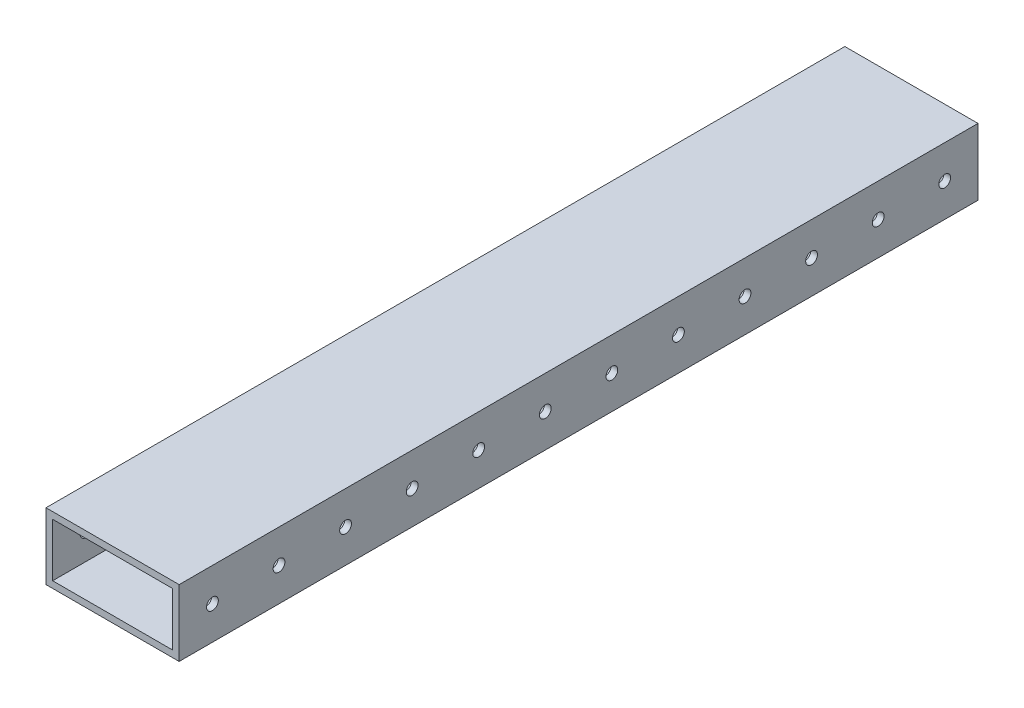
ISO-10303-21;
HEADER;
FILE_DESCRIPTION(('STEP AP214'),'2;1');
FILE_NAME('part.step','',(''),(''),'','','');
FILE_SCHEMA(('AUTOMOTIVE_DESIGN { 1 0 10303 214 1 1 1 1 }'));
ENDSEC;
DATA;
#1=APPLICATION_CONTEXT('core data for automotive mechanical design processes');
#2=APPLICATION_PROTOCOL_DEFINITION('international standard','automotive_design',2000,#1);
#3=PRODUCT_CONTEXT('',#1,'mechanical');
#4=PRODUCT('Part','Part','',(#3));
#5=PRODUCT_RELATED_PRODUCT_CATEGORY('part','',(#4));
#6=PRODUCT_DEFINITION_FORMATION('','',#4);
#7=PRODUCT_DEFINITION_CONTEXT('part definition',#1,'design');
#8=PRODUCT_DEFINITION('design','',#6,#7);
#9=PRODUCT_DEFINITION_SHAPE('','',#8);
#10=(LENGTH_UNIT() NAMED_UNIT(*) SI_UNIT(.MILLI.,.METRE.));
#11=(NAMED_UNIT(*) PLANE_ANGLE_UNIT() SI_UNIT($,.RADIAN.));
#12=(NAMED_UNIT(*) SI_UNIT($,.STERADIAN.) SOLID_ANGLE_UNIT());
#13=UNCERTAINTY_MEASURE_WITH_UNIT(LENGTH_MEASURE(1.E-05),#10,'distance_accuracy_value','');
#14=(GEOMETRIC_REPRESENTATION_CONTEXT(3) GLOBAL_UNCERTAINTY_ASSIGNED_CONTEXT((#13)) GLOBAL_UNIT_ASSIGNED_CONTEXT((#10,
#11,#12)) REPRESENTATION_CONTEXT('',''));
#15=CARTESIAN_POINT('',(0.,0.,0.));
#16=DIRECTION('',(0.,0.,1.));
#17=DIRECTION('',(1.,0.,0.));
#18=AXIS2_PLACEMENT_3D('',#15,#16,#17);
#19=CARTESIAN_POINT('',(-25.4,-12.7,-533.4));
#20=DIRECTION('',(-1.,0.,0.));
#21=DIRECTION('',(0.,0.,1.));
#22=AXIS2_PLACEMENT_3D('',#19,#20,#21);
#23=PLANE('',#22);
#24=DIRECTION('',(0.,-1.,0.));
#25=VECTOR('',#24,1.);
#26=CARTESIAN_POINT('',(-25.4,-12.7,-228.6));
#27=LINE('',#26,#25);
#28=CARTESIAN_POINT('',(-25.4,12.7,-228.6));
#29=VERTEX_POINT('',#28);
#30=CARTESIAN_POINT('',(-25.4,-12.7,-228.6));
#31=VERTEX_POINT('',#30);
#32=EDGE_CURVE('E102',#29,#31,#27,.T.);
#33=ORIENTED_EDGE('',*,*,#32,.F.);
#34=DIRECTION('',(0.,0.,1.));
#35=VECTOR('',#34,1.);
#36=CARTESIAN_POINT('',(-25.4,12.7,-533.4));
#37=LINE('',#36,#35);
#38=CARTESIAN_POINT('',(-25.4,12.7,-533.4));
#39=VERTEX_POINT('',#38);
#40=EDGE_CURVE('E112',#39,#29,#37,.T.);
#41=ORIENTED_EDGE('',*,*,#40,.F.);
#42=DIRECTION('',(0.,-1.,0.));
#43=VECTOR('',#42,1.);
#44=CARTESIAN_POINT('',(-25.4,-12.7,-533.4));
#45=LINE('',#44,#43);
#46=CARTESIAN_POINT('',(-25.4,-12.7,-533.4));
#47=VERTEX_POINT('',#46);
#48=EDGE_CURVE('E301',#39,#47,#45,.T.);
#49=ORIENTED_EDGE('',*,*,#48,.T.);
#50=DIRECTION('',(0.,0.,1.));
#51=VECTOR('',#50,1.);
#52=CARTESIAN_POINT('',(-25.4,-12.7,-533.4));
#53=LINE('',#52,#51);
#54=EDGE_CURVE('E114',#47,#31,#53,.T.);
#55=ORIENTED_EDGE('',*,*,#54,.T.);
#56=EDGE_LOOP('',(#33,#41,#49,#55));
#57=FACE_BOUND('',#56,.T.);
#58=CARTESIAN_POINT('',(-25.4,0.,-241.3));
#59=DIRECTION('',(1.,0.,0.));
#60=DIRECTION('',(0.,0.,-1.));
#61=AXIS2_PLACEMENT_3D('',#58,#59,#60);
#62=CIRCLE('',#61,2.24789999999999);
#63=CARTESIAN_POINT('',(-25.4,0.,-243.5479));
#64=VERTEX_POINT('',#63);
#65=EDGE_CURVE('E180',#64,#64,#62,.T.);
#66=ORIENTED_EDGE('',*,*,#65,.T.);
#67=EDGE_LOOP('',(#66));
#68=FACE_BOUND('',#67,.T.);
#69=CARTESIAN_POINT('',(-25.4,0.,-266.7));
#70=DIRECTION('',(1.,0.,0.));
#71=DIRECTION('',(0.,0.,-1.));
#72=AXIS2_PLACEMENT_3D('',#69,#70,#71);
#73=CIRCLE('',#72,2.24789999999999);
#74=CARTESIAN_POINT('',(-25.4,0.,-268.9479));
#75=VERTEX_POINT('',#74);
#76=EDGE_CURVE('E176',#75,#75,#73,.T.);
#77=ORIENTED_EDGE('',*,*,#76,.T.);
#78=EDGE_LOOP('',(#77));
#79=FACE_BOUND('',#78,.T.);
#80=CARTESIAN_POINT('',(-25.4,0.,-292.1));
#81=DIRECTION('',(1.,0.,0.));
#82=DIRECTION('',(0.,0.,-1.));
#83=AXIS2_PLACEMENT_3D('',#80,#81,#82);
#84=CIRCLE('',#83,2.24789999999999);
#85=CARTESIAN_POINT('',(-25.4,0.,-294.3479));
#86=VERTEX_POINT('',#85);
#87=EDGE_CURVE('E172',#86,#86,#84,.T.);
#88=ORIENTED_EDGE('',*,*,#87,.T.);
#89=EDGE_LOOP('',(#88));
#90=FACE_BOUND('',#89,.T.);
#91=CARTESIAN_POINT('',(-25.4,0.,-317.5));
#92=DIRECTION('',(1.,0.,0.));
#93=DIRECTION('',(0.,0.,-1.));
#94=AXIS2_PLACEMENT_3D('',#91,#92,#93);
#95=CIRCLE('',#94,2.24789999999999);
#96=CARTESIAN_POINT('',(-25.4,0.,-319.7479));
#97=VERTEX_POINT('',#96);
#98=EDGE_CURVE('E167',#97,#97,#95,.T.);
#99=ORIENTED_EDGE('',*,*,#98,.T.);
#100=EDGE_LOOP('',(#99));
#101=FACE_BOUND('',#100,.T.);
#102=CARTESIAN_POINT('',(-25.4,0.,-342.9));
#103=DIRECTION('',(1.,0.,0.));
#104=DIRECTION('',(0.,0.,-1.));
#105=AXIS2_PLACEMENT_3D('',#102,#103,#104);
#106=CIRCLE('',#105,2.24789999999999);
#107=CARTESIAN_POINT('',(-25.4,0.,-345.1479));
#108=VERTEX_POINT('',#107);
#109=EDGE_CURVE('E162',#108,#108,#106,.T.);
#110=ORIENTED_EDGE('',*,*,#109,.T.);
#111=EDGE_LOOP('',(#110));
#112=FACE_BOUND('',#111,.T.);
#113=CARTESIAN_POINT('',(-25.4,0.,-368.3));
#114=DIRECTION('',(1.,0.,0.));
#115=DIRECTION('',(0.,0.,-1.));
#116=AXIS2_PLACEMENT_3D('',#113,#114,#115);
#117=CIRCLE('',#116,2.24789999999999);
#118=CARTESIAN_POINT('',(-25.4,0.,-370.5479));
#119=VERTEX_POINT('',#118);
#120=EDGE_CURVE('E157',#119,#119,#117,.T.);
#121=ORIENTED_EDGE('',*,*,#120,.T.);
#122=EDGE_LOOP('',(#121));
#123=FACE_BOUND('',#122,.T.);
#124=CARTESIAN_POINT('',(-25.4,0.,-393.7));
#125=DIRECTION('',(1.,0.,0.));
#126=DIRECTION('',(0.,0.,-1.));
#127=AXIS2_PLACEMENT_3D('',#124,#125,#126);
#128=CIRCLE('',#127,2.24789999999999);
#129=CARTESIAN_POINT('',(-25.4,0.,-395.9479));
#130=VERTEX_POINT('',#129);
#131=EDGE_CURVE('E152',#130,#130,#128,.T.);
#132=ORIENTED_EDGE('',*,*,#131,.T.);
#133=EDGE_LOOP('',(#132));
#134=FACE_BOUND('',#133,.T.);
#135=CARTESIAN_POINT('',(-25.4,0.,-419.1));
#136=DIRECTION('',(1.,0.,0.));
#137=DIRECTION('',(0.,0.,-1.));
#138=AXIS2_PLACEMENT_3D('',#135,#136,#137);
#139=CIRCLE('',#138,2.24789999999999);
#140=CARTESIAN_POINT('',(-25.4,0.,-421.3479));
#141=VERTEX_POINT('',#140);
#142=EDGE_CURVE('E147',#141,#141,#139,.T.);
#143=ORIENTED_EDGE('',*,*,#142,.T.);
#144=EDGE_LOOP('',(#143));
#145=FACE_BOUND('',#144,.T.);
#146=CARTESIAN_POINT('',(-25.4,0.,-444.5));
#147=DIRECTION('',(1.,0.,0.));
#148=DIRECTION('',(0.,0.,-1.));
#149=AXIS2_PLACEMENT_3D('',#146,#147,#148);
#150=CIRCLE('',#149,2.24789999999999);
#151=CARTESIAN_POINT('',(-25.4,0.,-446.7479));
#152=VERTEX_POINT('',#151);
#153=EDGE_CURVE('E142',#152,#152,#150,.T.);
#154=ORIENTED_EDGE('',*,*,#153,.T.);
#155=EDGE_LOOP('',(#154));
#156=FACE_BOUND('',#155,.T.);
#157=CARTESIAN_POINT('',(-25.4,0.,-469.9));
#158=DIRECTION('',(1.,0.,0.));
#159=DIRECTION('',(0.,0.,-1.));
#160=AXIS2_PLACEMENT_3D('',#157,#158,#159);
#161=CIRCLE('',#160,2.24789999999999);
#162=CARTESIAN_POINT('',(-25.4,0.,-472.1479));
#163=VERTEX_POINT('',#162);
#164=EDGE_CURVE('E137',#163,#163,#161,.T.);
#165=ORIENTED_EDGE('',*,*,#164,.T.);
#166=EDGE_LOOP('',(#165));
#167=FACE_BOUND('',#166,.T.);
#168=CARTESIAN_POINT('',(-25.4,0.,-495.3));
#169=DIRECTION('',(1.,0.,0.));
#170=DIRECTION('',(0.,0.,-1.));
#171=AXIS2_PLACEMENT_3D('',#168,#169,#170);
#172=CIRCLE('',#171,2.24789999999999);
#173=CARTESIAN_POINT('',(-25.4,0.,-497.5479));
#174=VERTEX_POINT('',#173);
#175=EDGE_CURVE('E132',#174,#174,#172,.T.);
#176=ORIENTED_EDGE('',*,*,#175,.T.);
#177=EDGE_LOOP('',(#176));
#178=FACE_BOUND('',#177,.T.);
#179=CARTESIAN_POINT('',(-25.4,0.,-520.7));
#180=DIRECTION('',(1.,0.,0.));
#181=DIRECTION('',(0.,0.,-1.));
#182=AXIS2_PLACEMENT_3D('',#179,#180,#181);
#183=CIRCLE('',#182,2.24789999999999);
#184=CARTESIAN_POINT('',(-25.4,0.,-522.9479));
#185=VERTEX_POINT('',#184);
#186=EDGE_CURVE('E264',#185,#185,#183,.T.);
#187=ORIENTED_EDGE('',*,*,#186,.T.);
#188=EDGE_LOOP('',(#187));
#189=FACE_BOUND('',#188,.T.);
#190=ADVANCED_FACE('F38',(#57,#68,#79,#90,#101,#112,#123,#134,#145,#156,#167,#178,#189),#23,.T.);
#191=CARTESIAN_POINT('',(25.4,-12.7,-533.4));
#192=DIRECTION('',(1.,0.,0.));
#193=DIRECTION('',(0.,0.,-1.));
#194=AXIS2_PLACEMENT_3D('',#191,#192,#193);
#195=PLANE('',#194);
#196=DIRECTION('',(0.,1.,0.));
#197=VECTOR('',#196,1.);
#198=CARTESIAN_POINT('',(25.4,-12.7,-228.6));
#199=LINE('',#198,#197);
#200=CARTESIAN_POINT('',(25.4,-12.7,-228.6));
#201=VERTEX_POINT('',#200);
#202=CARTESIAN_POINT('',(25.4,12.7,-228.6));
#203=VERTEX_POINT('',#202);
#204=EDGE_CURVE('E53',#201,#203,#199,.T.);
#205=ORIENTED_EDGE('',*,*,#204,.F.);
#206=DIRECTION('',(0.,0.,1.));
#207=VECTOR('',#206,1.);
#208=CARTESIAN_POINT('',(25.4,-12.7,-533.4));
#209=LINE('',#208,#207);
#210=CARTESIAN_POINT('',(25.4,-12.7,-533.4));
#211=VERTEX_POINT('',#210);
#212=EDGE_CURVE('E46',#211,#201,#209,.T.);
#213=ORIENTED_EDGE('',*,*,#212,.F.);
#214=DIRECTION('',(0.,1.,0.));
#215=VECTOR('',#214,1.);
#216=CARTESIAN_POINT('',(25.4,-12.7,-533.4));
#217=LINE('',#216,#215);
#218=CARTESIAN_POINT('',(25.4,12.7,-533.4));
#219=VERTEX_POINT('',#218);
#220=EDGE_CURVE('E289',#211,#219,#217,.T.);
#221=ORIENTED_EDGE('',*,*,#220,.T.);
#222=DIRECTION('',(0.,0.,1.));
#223=VECTOR('',#222,1.);
#224=CARTESIAN_POINT('',(25.4,12.7,-533.4));
#225=LINE('',#224,#223);
#226=EDGE_CURVE('E121',#219,#203,#225,.T.);
#227=ORIENTED_EDGE('',*,*,#226,.T.);
#228=EDGE_LOOP('',(#205,#213,#221,#227));
#229=FACE_BOUND('',#228,.T.);
#230=CARTESIAN_POINT('',(25.4,0.,-241.3));
#231=DIRECTION('',(1.,0.,0.));
#232=DIRECTION('',(0.,0.,-1.));
#233=AXIS2_PLACEMENT_3D('',#230,#231,#232);
#234=CIRCLE('',#233,2.24789999999999);
#235=CARTESIAN_POINT('',(25.4,0.,-243.5479));
#236=VERTEX_POINT('',#235);
#237=EDGE_CURVE('E115',#236,#236,#234,.T.);
#238=ORIENTED_EDGE('',*,*,#237,.F.);
#239=EDGE_LOOP('',(#238));
#240=FACE_BOUND('',#239,.T.);
#241=CARTESIAN_POINT('',(25.4,0.,-266.7));
#242=DIRECTION('',(1.,0.,0.));
#243=DIRECTION('',(0.,0.,-1.));
#244=AXIS2_PLACEMENT_3D('',#241,#242,#243);
#245=CIRCLE('',#244,2.24789999999999);
#246=CARTESIAN_POINT('',(25.4,0.,-268.9479));
#247=VERTEX_POINT('',#246);
#248=EDGE_CURVE('E184',#247,#247,#245,.T.);
#249=ORIENTED_EDGE('',*,*,#248,.F.);
#250=EDGE_LOOP('',(#249));
#251=FACE_BOUND('',#250,.T.);
#252=CARTESIAN_POINT('',(25.4,0.,-292.1));
#253=DIRECTION('',(1.,0.,0.));
#254=DIRECTION('',(0.,0.,-1.));
#255=AXIS2_PLACEMENT_3D('',#252,#253,#254);
#256=CIRCLE('',#255,2.24789999999999);
#257=CARTESIAN_POINT('',(25.4,0.,-294.3479));
#258=VERTEX_POINT('',#257);
#259=EDGE_CURVE('E198',#258,#258,#256,.T.);
#260=ORIENTED_EDGE('',*,*,#259,.F.);
#261=EDGE_LOOP('',(#260));
#262=FACE_BOUND('',#261,.T.);
#263=CARTESIAN_POINT('',(25.4,0.,-317.5));
#264=DIRECTION('',(1.,0.,0.));
#265=DIRECTION('',(0.,0.,-1.));
#266=AXIS2_PLACEMENT_3D('',#263,#264,#265);
#267=CIRCLE('',#266,2.24789999999999);
#268=CARTESIAN_POINT('',(25.4,0.,-319.7479));
#269=VERTEX_POINT('',#268);
#270=EDGE_CURVE('E205',#269,#269,#267,.T.);
#271=ORIENTED_EDGE('',*,*,#270,.F.);
#272=EDGE_LOOP('',(#271));
#273=FACE_BOUND('',#272,.T.);
#274=CARTESIAN_POINT('',(25.4,0.,-342.9));
#275=DIRECTION('',(1.,0.,0.));
#276=DIRECTION('',(0.,0.,-1.));
#277=AXIS2_PLACEMENT_3D('',#274,#275,#276);
#278=CIRCLE('',#277,2.24789999999999);
#279=CARTESIAN_POINT('',(25.4,0.,-345.1479));
#280=VERTEX_POINT('',#279);
#281=EDGE_CURVE('E212',#280,#280,#278,.T.);
#282=ORIENTED_EDGE('',*,*,#281,.F.);
#283=EDGE_LOOP('',(#282));
#284=FACE_BOUND('',#283,.T.);
#285=CARTESIAN_POINT('',(25.4,0.,-368.3));
#286=DIRECTION('',(1.,0.,0.));
#287=DIRECTION('',(0.,0.,-1.));
#288=AXIS2_PLACEMENT_3D('',#285,#286,#287);
#289=CIRCLE('',#288,2.24789999999999);
#290=CARTESIAN_POINT('',(25.4,0.,-370.5479));
#291=VERTEX_POINT('',#290);
#292=EDGE_CURVE('E219',#291,#291,#289,.T.);
#293=ORIENTED_EDGE('',*,*,#292,.F.);
#294=EDGE_LOOP('',(#293));
#295=FACE_BOUND('',#294,.T.);
#296=CARTESIAN_POINT('',(25.4,0.,-393.7));
#297=DIRECTION('',(1.,0.,0.));
#298=DIRECTION('',(0.,0.,-1.));
#299=AXIS2_PLACEMENT_3D('',#296,#297,#298);
#300=CIRCLE('',#299,2.24789999999999);
#301=CARTESIAN_POINT('',(25.4,0.,-395.9479));
#302=VERTEX_POINT('',#301);
#303=EDGE_CURVE('E226',#302,#302,#300,.T.);
#304=ORIENTED_EDGE('',*,*,#303,.F.);
#305=EDGE_LOOP('',(#304));
#306=FACE_BOUND('',#305,.T.);
#307=CARTESIAN_POINT('',(25.4,0.,-419.1));
#308=DIRECTION('',(1.,0.,0.));
#309=DIRECTION('',(0.,0.,-1.));
#310=AXIS2_PLACEMENT_3D('',#307,#308,#309);
#311=CIRCLE('',#310,2.24789999999999);
#312=CARTESIAN_POINT('',(25.4,0.,-421.3479));
#313=VERTEX_POINT('',#312);
#314=EDGE_CURVE('E233',#313,#313,#311,.T.);
#315=ORIENTED_EDGE('',*,*,#314,.F.);
#316=EDGE_LOOP('',(#315));
#317=FACE_BOUND('',#316,.T.);
#318=CARTESIAN_POINT('',(25.4,0.,-444.5));
#319=DIRECTION('',(1.,0.,0.));
#320=DIRECTION('',(0.,0.,-1.));
#321=AXIS2_PLACEMENT_3D('',#318,#319,#320);
#322=CIRCLE('',#321,2.24789999999999);
#323=CARTESIAN_POINT('',(25.4,0.,-446.7479));
#324=VERTEX_POINT('',#323);
#325=EDGE_CURVE('E240',#324,#324,#322,.T.);
#326=ORIENTED_EDGE('',*,*,#325,.F.);
#327=EDGE_LOOP('',(#326));
#328=FACE_BOUND('',#327,.T.);
#329=CARTESIAN_POINT('',(25.4,0.,-469.9));
#330=DIRECTION('',(1.,0.,0.));
#331=DIRECTION('',(0.,0.,-1.));
#332=AXIS2_PLACEMENT_3D('',#329,#330,#331);
#333=CIRCLE('',#332,2.24789999999999);
#334=CARTESIAN_POINT('',(25.4,0.,-472.1479));
#335=VERTEX_POINT('',#334);
#336=EDGE_CURVE('E247',#335,#335,#333,.T.);
#337=ORIENTED_EDGE('',*,*,#336,.F.);
#338=EDGE_LOOP('',(#337));
#339=FACE_BOUND('',#338,.T.);
#340=CARTESIAN_POINT('',(25.4,0.,-495.3));
#341=DIRECTION('',(1.,0.,0.));
#342=DIRECTION('',(0.,0.,-1.));
#343=AXIS2_PLACEMENT_3D('',#340,#341,#342);
#344=CIRCLE('',#343,2.24789999999999);
#345=CARTESIAN_POINT('',(25.4,0.,-497.5479));
#346=VERTEX_POINT('',#345);
#347=EDGE_CURVE('E254',#346,#346,#344,.T.);
#348=ORIENTED_EDGE('',*,*,#347,.F.);
#349=EDGE_LOOP('',(#348));
#350=FACE_BOUND('',#349,.T.);
#351=CARTESIAN_POINT('',(25.4,0.,-520.7));
#352=DIRECTION('',(1.,0.,0.));
#353=DIRECTION('',(0.,0.,-1.));
#354=AXIS2_PLACEMENT_3D('',#351,#352,#353);
#355=CIRCLE('',#354,2.24789999999999);
#356=CARTESIAN_POINT('',(25.4,0.,-522.9479));
#357=VERTEX_POINT('',#356);
#358=EDGE_CURVE('E261',#357,#357,#355,.T.);
#359=ORIENTED_EDGE('',*,*,#358,.F.);
#360=EDGE_LOOP('',(#359));
#361=FACE_BOUND('',#360,.T.);
#362=ADVANCED_FACE('F40',(#229,#240,#251,#262,#273,#284,#295,#306,#317,#328,#339,#350,#361),
#195,.T.);
#363=CARTESIAN_POINT('',(-25.4,-12.7,-533.4));
#364=DIRECTION('',(0.,-1.,0.));
#365=DIRECTION('',(0.,0.,-1.));
#366=AXIS2_PLACEMENT_3D('',#363,#364,#365);
#367=PLANE('',#366);
#368=DIRECTION('',(1.,0.,0.));
#369=VECTOR('',#368,1.);
#370=CARTESIAN_POINT('',(-25.4,-12.7,-228.6));
#371=LINE('',#370,#369);
#372=EDGE_CURVE('E307',#31,#201,#371,.T.);
#373=ORIENTED_EDGE('',*,*,#372,.F.);
#374=ORIENTED_EDGE('',*,*,#54,.F.);
#375=DIRECTION('',(1.,0.,0.));
#376=VECTOR('',#375,1.);
#377=CARTESIAN_POINT('',(-25.4,-12.7,-533.4));
#378=LINE('',#377,#376);
#379=EDGE_CURVE('E124',#47,#211,#378,.T.);
#380=ORIENTED_EDGE('',*,*,#379,.T.);
#381=ORIENTED_EDGE('',*,*,#212,.T.);
#382=EDGE_LOOP('',(#373,#374,#380,#381));
#383=FACE_BOUND('',#382,.T.);
#384=ADVANCED_FACE('F306',(#383),#367,.T.);
#385=CARTESIAN_POINT('',(-25.4,12.7,-533.4));
#386=DIRECTION('',(0.,1.,0.));
#387=DIRECTION('',(0.,0.,1.));
#388=AXIS2_PLACEMENT_3D('',#385,#386,#387);
#389=PLANE('',#388);
#390=DIRECTION('',(-1.,0.,0.));
#391=VECTOR('',#390,1.);
#392=CARTESIAN_POINT('',(-94.0568861231913,12.7,-228.6));
#393=LINE('',#392,#391);
#394=EDGE_CURVE('E99',#203,#29,#393,.T.);
#395=ORIENTED_EDGE('',*,*,#394,.F.);
#396=ORIENTED_EDGE('',*,*,#226,.F.);
#397=DIRECTION('',(-1.,0.,0.));
#398=VECTOR('',#397,1.);
#399=CARTESIAN_POINT('',(-25.4,12.7,-533.4));
#400=LINE('',#399,#398);
#401=EDGE_CURVE('E120',#219,#39,#400,.T.);
#402=ORIENTED_EDGE('',*,*,#401,.T.);
#403=ORIENTED_EDGE('',*,*,#40,.T.);
#404=EDGE_LOOP('',(#395,#396,#402,#403));
#405=FACE_BOUND('',#404,.T.);
#406=ADVANCED_FACE('F118',(#405),#389,.T.);
#407=CARTESIAN_POINT('',(0.,0.,-533.4));
#408=DIRECTION('',(0.,0.,-1.));
#409=DIRECTION('',(-1.,0.,0.));
#410=AXIS2_PLACEMENT_3D('',#407,#408,#409);
#411=PLANE('',#410);
#412=DIRECTION('',(0.,1.,0.));
#413=VECTOR('',#412,1.);
#414=CARTESIAN_POINT('',(22.86,-10.16,-533.4));
#415=LINE('',#414,#413);
#416=CARTESIAN_POINT('',(22.86,-10.16,-533.4));
#417=VERTEX_POINT('',#416);
#418=CARTESIAN_POINT('',(22.86,10.16,-533.4));
#419=VERTEX_POINT('',#418);
#420=EDGE_CURVE('E273',#417,#419,#415,.T.);
#421=ORIENTED_EDGE('',*,*,#420,.T.);
#422=DIRECTION('',(-1.,0.,0.));
#423=VECTOR('',#422,1.);
#424=CARTESIAN_POINT('',(-22.86,10.16,-533.4));
#425=LINE('',#424,#423);
#426=CARTESIAN_POINT('',(-22.86,10.16,-533.4));
#427=VERTEX_POINT('',#426);
#428=EDGE_CURVE('E276',#419,#427,#425,.T.);
#429=ORIENTED_EDGE('',*,*,#428,.T.);
#430=DIRECTION('',(0.,-1.,0.));
#431=VECTOR('',#430,1.);
#432=CARTESIAN_POINT('',(-22.86,-10.16,-533.4));
#433=LINE('',#432,#431);
#434=CARTESIAN_POINT('',(-22.86,-10.16,-533.4));
#435=VERTEX_POINT('',#434);
#436=EDGE_CURVE('E279',#427,#435,#433,.T.);
#437=ORIENTED_EDGE('',*,*,#436,.T.);
#438=DIRECTION('',(1.,0.,0.));
#439=VECTOR('',#438,1.);
#440=CARTESIAN_POINT('',(-22.86,-10.16,-533.4));
#441=LINE('',#440,#439);
#442=EDGE_CURVE('E282',#435,#417,#441,.T.);
#443=ORIENTED_EDGE('',*,*,#442,.T.);
#444=EDGE_LOOP('',(#421,#429,#437,#443));
#445=FACE_BOUND('',#444,.T.);
#446=ORIENTED_EDGE('',*,*,#220,.F.);
#447=ORIENTED_EDGE('',*,*,#379,.F.);
#448=ORIENTED_EDGE('',*,*,#48,.F.);
#449=ORIENTED_EDGE('',*,*,#401,.F.);
#450=EDGE_LOOP('',(#446,#447,#448,#449));
#451=FACE_BOUND('',#450,.T.);
#452=ADVANCED_FACE('F313',(#445,#451),#411,.T.);
#453=CARTESIAN_POINT('',(22.86,-10.16,-533.4));
#454=DIRECTION('',(1.,0.,0.));
#455=DIRECTION('',(0.,0.,-1.));
#456=AXIS2_PLACEMENT_3D('',#453,#454,#455);
#457=PLANE('',#456);
#458=CARTESIAN_POINT('',(22.86,0.,-241.3));
#459=DIRECTION('',(1.,0.,0.));
#460=DIRECTION('',(0.,0.,-1.));
#461=AXIS2_PLACEMENT_3D('',#458,#459,#460);
#462=CIRCLE('',#461,2.24789999999999);
#463=CARTESIAN_POINT('',(22.86,0.,-243.5479));
#464=VERTEX_POINT('',#463);
#465=EDGE_CURVE('E179',#464,#464,#462,.T.);
#466=ORIENTED_EDGE('',*,*,#465,.T.);
#467=EDGE_LOOP('',(#466));
#468=FACE_BOUND('',#467,.T.);
#469=CARTESIAN_POINT('',(22.86,0.,-266.7));
#470=DIRECTION('',(1.,0.,0.));
#471=DIRECTION('',(0.,0.,-1.));
#472=AXIS2_PLACEMENT_3D('',#469,#470,#471);
#473=CIRCLE('',#472,2.24789999999999);
#474=CARTESIAN_POINT('',(22.86,0.,-268.9479));
#475=VERTEX_POINT('',#474);
#476=EDGE_CURVE('E175',#475,#475,#473,.T.);
#477=ORIENTED_EDGE('',*,*,#476,.T.);
#478=EDGE_LOOP('',(#477));
#479=FACE_BOUND('',#478,.T.);
#480=CARTESIAN_POINT('',(22.86,0.,-292.1));
#481=DIRECTION('',(1.,0.,0.));
#482=DIRECTION('',(0.,0.,-1.));
#483=AXIS2_PLACEMENT_3D('',#480,#481,#482);
#484=CIRCLE('',#483,2.24789999999999);
#485=CARTESIAN_POINT('',(22.86,0.,-294.3479));
#486=VERTEX_POINT('',#485);
#487=EDGE_CURVE('E171',#486,#486,#484,.T.);
#488=ORIENTED_EDGE('',*,*,#487,.T.);
#489=EDGE_LOOP('',(#488));
#490=FACE_BOUND('',#489,.T.);
#491=CARTESIAN_POINT('',(22.86,0.,-317.5));
#492=DIRECTION('',(1.,0.,0.));
#493=DIRECTION('',(0.,0.,-1.));
#494=AXIS2_PLACEMENT_3D('',#491,#492,#493);
#495=CIRCLE('',#494,2.24789999999999);
#496=CARTESIAN_POINT('',(22.86,0.,-319.7479));
#497=VERTEX_POINT('',#496);
#498=EDGE_CURVE('E166',#497,#497,#495,.T.);
#499=ORIENTED_EDGE('',*,*,#498,.T.);
#500=EDGE_LOOP('',(#499));
#501=FACE_BOUND('',#500,.T.);
#502=CARTESIAN_POINT('',(22.86,0.,-342.9));
#503=DIRECTION('',(1.,0.,0.));
#504=DIRECTION('',(0.,0.,-1.));
#505=AXIS2_PLACEMENT_3D('',#502,#503,#504);
#506=CIRCLE('',#505,2.24789999999999);
#507=CARTESIAN_POINT('',(22.86,0.,-345.1479));
#508=VERTEX_POINT('',#507);
#509=EDGE_CURVE('E161',#508,#508,#506,.T.);
#510=ORIENTED_EDGE('',*,*,#509,.T.);
#511=EDGE_LOOP('',(#510));
#512=FACE_BOUND('',#511,.T.);
#513=CARTESIAN_POINT('',(22.86,0.,-368.3));
#514=DIRECTION('',(1.,0.,0.));
#515=DIRECTION('',(0.,0.,-1.));
#516=AXIS2_PLACEMENT_3D('',#513,#514,#515);
#517=CIRCLE('',#516,2.24789999999999);
#518=CARTESIAN_POINT('',(22.86,0.,-370.5479));
#519=VERTEX_POINT('',#518);
#520=EDGE_CURVE('E156',#519,#519,#517,.T.);
#521=ORIENTED_EDGE('',*,*,#520,.T.);
#522=EDGE_LOOP('',(#521));
#523=FACE_BOUND('',#522,.T.);
#524=CARTESIAN_POINT('',(22.86,0.,-393.7));
#525=DIRECTION('',(1.,0.,0.));
#526=DIRECTION('',(0.,0.,-1.));
#527=AXIS2_PLACEMENT_3D('',#524,#525,#526);
#528=CIRCLE('',#527,2.24789999999999);
#529=CARTESIAN_POINT('',(22.86,0.,-395.9479));
#530=VERTEX_POINT('',#529);
#531=EDGE_CURVE('E151',#530,#530,#528,.T.);
#532=ORIENTED_EDGE('',*,*,#531,.T.);
#533=EDGE_LOOP('',(#532));
#534=FACE_BOUND('',#533,.T.);
#535=CARTESIAN_POINT('',(22.86,0.,-419.1));
#536=DIRECTION('',(1.,0.,0.));
#537=DIRECTION('',(0.,0.,-1.));
#538=AXIS2_PLACEMENT_3D('',#535,#536,#537);
#539=CIRCLE('',#538,2.24789999999999);
#540=CARTESIAN_POINT('',(22.86,0.,-421.3479));
#541=VERTEX_POINT('',#540);
#542=EDGE_CURVE('E146',#541,#541,#539,.T.);
#543=ORIENTED_EDGE('',*,*,#542,.T.);
#544=EDGE_LOOP('',(#543));
#545=FACE_BOUND('',#544,.T.);
#546=CARTESIAN_POINT('',(22.86,0.,-444.5));
#547=DIRECTION('',(1.,0.,0.));
#548=DIRECTION('',(0.,0.,-1.));
#549=AXIS2_PLACEMENT_3D('',#546,#547,#548);
#550=CIRCLE('',#549,2.24789999999999);
#551=CARTESIAN_POINT('',(22.86,0.,-446.7479));
#552=VERTEX_POINT('',#551);
#553=EDGE_CURVE('E138',#552,#552,#550,.T.);
#554=ORIENTED_EDGE('',*,*,#553,.T.);
#555=EDGE_LOOP('',(#554));
#556=FACE_BOUND('',#555,.T.);
#557=CARTESIAN_POINT('',(22.86,0.,-469.9));
#558=DIRECTION('',(1.,0.,0.));
#559=DIRECTION('',(0.,0.,-1.));
#560=AXIS2_PLACEMENT_3D('',#557,#558,#559);
#561=CIRCLE('',#560,2.24789999999999);
#562=CARTESIAN_POINT('',(22.86,0.,-472.1479));
#563=VERTEX_POINT('',#562);
#564=EDGE_CURVE('E133',#563,#563,#561,.T.);
#565=ORIENTED_EDGE('',*,*,#564,.T.);
#566=EDGE_LOOP('',(#565));
#567=FACE_BOUND('',#566,.T.);
#568=CARTESIAN_POINT('',(22.86,0.,-495.3));
#569=DIRECTION('',(1.,0.,0.));
#570=DIRECTION('',(0.,0.,-1.));
#571=AXIS2_PLACEMENT_3D('',#568,#569,#570);
#572=CIRCLE('',#571,2.24789999999999);
#573=CARTESIAN_POINT('',(22.86,0.,-497.5479));
#574=VERTEX_POINT('',#573);
#575=EDGE_CURVE('E128',#574,#574,#572,.T.);
#576=ORIENTED_EDGE('',*,*,#575,.T.);
#577=EDGE_LOOP('',(#576));
#578=FACE_BOUND('',#577,.T.);
#579=CARTESIAN_POINT('',(22.86,0.,-520.7));
#580=DIRECTION('',(1.,0.,0.));
#581=DIRECTION('',(0.,0.,-1.));
#582=AXIS2_PLACEMENT_3D('',#579,#580,#581);
#583=CIRCLE('',#582,2.24789999999999);
#584=CARTESIAN_POINT('',(22.86,0.,-522.9479));
#585=VERTEX_POINT('',#584);
#586=EDGE_CURVE('E267',#585,#585,#583,.T.);
#587=ORIENTED_EDGE('',*,*,#586,.T.);
#588=EDGE_LOOP('',(#587));
#589=FACE_BOUND('',#588,.T.);
#590=DIRECTION('',(0.,0.,1.));
#591=VECTOR('',#590,1.);
#592=CARTESIAN_POINT('',(22.86,-10.16,-533.4));
#593=LINE('',#592,#591);
#594=CARTESIAN_POINT('',(22.86,-10.16,-228.6));
#595=VERTEX_POINT('',#594);
#596=EDGE_CURVE('E286',#417,#595,#593,.T.);
#597=ORIENTED_EDGE('',*,*,#596,.T.);
#598=DIRECTION('',(0.,1.,0.));
#599=VECTOR('',#598,1.);
#600=CARTESIAN_POINT('',(22.86,-10.16,-228.6));
#601=LINE('',#600,#599);
#602=CARTESIAN_POINT('',(22.86,10.16,-228.6));
#603=VERTEX_POINT('',#602);
#604=EDGE_CURVE('E642',#595,#603,#601,.T.);
#605=ORIENTED_EDGE('',*,*,#604,.T.);
#606=DIRECTION('',(0.,0.,1.));
#607=VECTOR('',#606,1.);
#608=CARTESIAN_POINT('',(22.86,10.16,-533.4));
#609=LINE('',#608,#607);
#610=EDGE_CURVE('E285',#419,#603,#609,.T.);
#611=ORIENTED_EDGE('',*,*,#610,.F.);
#612=ORIENTED_EDGE('',*,*,#420,.F.);
#613=EDGE_LOOP('',(#597,#605,#611,#612));
#614=FACE_BOUND('',#613,.T.);
#615=ADVANCED_FACE('F315',(#468,#479,#490,#501,#512,#523,#534,#545,#556,#567,#578,#589,#614),
#457,.F.);
#616=CARTESIAN_POINT('',(-22.86,-10.16,-533.4));
#617=DIRECTION('',(0.,-1.,0.));
#618=DIRECTION('',(0.,0.,-1.));
#619=AXIS2_PLACEMENT_3D('',#616,#617,#618);
#620=PLANE('',#619);
#621=DIRECTION('',(0.,0.,1.));
#622=VECTOR('',#621,1.);
#623=CARTESIAN_POINT('',(-22.86,-10.16,-533.4));
#624=LINE('',#623,#622);
#625=CARTESIAN_POINT('',(-22.86,-10.16,-228.6));
#626=VERTEX_POINT('',#625);
#627=EDGE_CURVE('E290',#435,#626,#624,.T.);
#628=ORIENTED_EDGE('',*,*,#627,.T.);
#629=DIRECTION('',(1.,0.,0.));
#630=VECTOR('',#629,1.);
#631=CARTESIAN_POINT('',(-22.86,-10.16,-228.6));
#632=LINE('',#631,#630);
#633=EDGE_CURVE('E644',#626,#595,#632,.T.);
#634=ORIENTED_EDGE('',*,*,#633,.T.);
#635=ORIENTED_EDGE('',*,*,#596,.F.);
#636=ORIENTED_EDGE('',*,*,#442,.F.);
#637=EDGE_LOOP('',(#628,#634,#635,#636));
#638=FACE_BOUND('',#637,.T.);
#639=ADVANCED_FACE('F323',(#638),#620,.F.);
#640=CARTESIAN_POINT('',(-22.86,-10.16,-533.4));
#641=DIRECTION('',(-1.,0.,0.));
#642=DIRECTION('',(0.,0.,1.));
#643=AXIS2_PLACEMENT_3D('',#640,#641,#642);
#644=PLANE('',#643);
#645=CARTESIAN_POINT('',(-22.86,0.,-241.3));
#646=DIRECTION('',(-1.,0.,0.));
#647=DIRECTION('',(0.,0.,1.));
#648=AXIS2_PLACEMENT_3D('',#645,#646,#647);
#649=CIRCLE('',#648,2.24789999999999);
#650=CARTESIAN_POINT('',(-22.86,0.,-239.0521));
#651=VERTEX_POINT('',#650);
#652=EDGE_CURVE('E177',#651,#651,#649,.T.);
#653=ORIENTED_EDGE('',*,*,#652,.T.);
#654=EDGE_LOOP('',(#653));
#655=FACE_BOUND('',#654,.T.);
#656=CARTESIAN_POINT('',(-22.86,0.,-266.7));
#657=DIRECTION('',(-1.,0.,0.));
#658=DIRECTION('',(0.,0.,1.));
#659=AXIS2_PLACEMENT_3D('',#656,#657,#658);
#660=CIRCLE('',#659,2.24789999999999);
#661=CARTESIAN_POINT('',(-22.86,0.,-264.4521));
#662=VERTEX_POINT('',#661);
#663=EDGE_CURVE('E173',#662,#662,#660,.T.);
#664=ORIENTED_EDGE('',*,*,#663,.T.);
#665=EDGE_LOOP('',(#664));
#666=FACE_BOUND('',#665,.T.);
#667=CARTESIAN_POINT('',(-22.86,0.,-292.1));
#668=DIRECTION('',(-1.,0.,0.));
#669=DIRECTION('',(0.,0.,1.));
#670=AXIS2_PLACEMENT_3D('',#667,#668,#669);
#671=CIRCLE('',#670,2.24789999999999);
#672=CARTESIAN_POINT('',(-22.86,0.,-289.8521));
#673=VERTEX_POINT('',#672);
#674=EDGE_CURVE('E168',#673,#673,#671,.T.);
#675=ORIENTED_EDGE('',*,*,#674,.T.);
#676=EDGE_LOOP('',(#675));
#677=FACE_BOUND('',#676,.T.);
#678=CARTESIAN_POINT('',(-22.86,0.,-317.5));
#679=DIRECTION('',(-1.,0.,0.));
#680=DIRECTION('',(0.,0.,1.));
#681=AXIS2_PLACEMENT_3D('',#678,#679,#680);
#682=CIRCLE('',#681,2.24789999999999);
#683=CARTESIAN_POINT('',(-22.86,0.,-315.2521));
#684=VERTEX_POINT('',#683);
#685=EDGE_CURVE('E163',#684,#684,#682,.T.);
#686=ORIENTED_EDGE('',*,*,#685,.T.);
#687=EDGE_LOOP('',(#686));
#688=FACE_BOUND('',#687,.T.);
#689=CARTESIAN_POINT('',(-22.86,0.,-342.9));
#690=DIRECTION('',(-1.,0.,0.));
#691=DIRECTION('',(0.,0.,1.));
#692=AXIS2_PLACEMENT_3D('',#689,#690,#691);
#693=CIRCLE('',#692,2.24789999999999);
#694=CARTESIAN_POINT('',(-22.86,0.,-340.6521));
#695=VERTEX_POINT('',#694);
#696=EDGE_CURVE('E158',#695,#695,#693,.T.);
#697=ORIENTED_EDGE('',*,*,#696,.T.);
#698=EDGE_LOOP('',(#697));
#699=FACE_BOUND('',#698,.T.);
#700=CARTESIAN_POINT('',(-22.86,0.,-368.3));
#701=DIRECTION('',(-1.,0.,0.));
#702=DIRECTION('',(0.,0.,1.));
#703=AXIS2_PLACEMENT_3D('',#700,#701,#702);
#704=CIRCLE('',#703,2.24789999999999);
#705=CARTESIAN_POINT('',(-22.86,0.,-366.0521));
#706=VERTEX_POINT('',#705);
#707=EDGE_CURVE('E153',#706,#706,#704,.T.);
#708=ORIENTED_EDGE('',*,*,#707,.T.);
#709=EDGE_LOOP('',(#708));
#710=FACE_BOUND('',#709,.T.);
#711=CARTESIAN_POINT('',(-22.86,0.,-393.7));
#712=DIRECTION('',(-1.,0.,0.));
#713=DIRECTION('',(0.,0.,1.));
#714=AXIS2_PLACEMENT_3D('',#711,#712,#713);
#715=CIRCLE('',#714,2.24789999999999);
#716=CARTESIAN_POINT('',(-22.86,0.,-391.4521));
#717=VERTEX_POINT('',#716);
#718=EDGE_CURVE('E148',#717,#717,#715,.T.);
#719=ORIENTED_EDGE('',*,*,#718,.T.);
#720=EDGE_LOOP('',(#719));
#721=FACE_BOUND('',#720,.T.);
#722=CARTESIAN_POINT('',(-22.86,0.,-419.1));
#723=DIRECTION('',(-1.,0.,0.));
#724=DIRECTION('',(0.,0.,1.));
#725=AXIS2_PLACEMENT_3D('',#722,#723,#724);
#726=CIRCLE('',#725,2.24789999999999);
#727=CARTESIAN_POINT('',(-22.86,0.,-416.8521));
#728=VERTEX_POINT('',#727);
#729=EDGE_CURVE('E143',#728,#728,#726,.T.);
#730=ORIENTED_EDGE('',*,*,#729,.T.);
#731=EDGE_LOOP('',(#730));
#732=FACE_BOUND('',#731,.T.);
#733=CARTESIAN_POINT('',(-22.86,0.,-444.5));
#734=DIRECTION('',(-1.,0.,0.));
#735=DIRECTION('',(0.,0.,1.));
#736=AXIS2_PLACEMENT_3D('',#733,#734,#735);
#737=CIRCLE('',#736,2.24789999999999);
#738=CARTESIAN_POINT('',(-22.86,0.,-442.2521));
#739=VERTEX_POINT('',#738);
#740=EDGE_CURVE('E141',#739,#739,#737,.T.);
#741=ORIENTED_EDGE('',*,*,#740,.T.);
#742=EDGE_LOOP('',(#741));
#743=FACE_BOUND('',#742,.T.);
#744=CARTESIAN_POINT('',(-22.86,0.,-469.9));
#745=DIRECTION('',(-1.,0.,0.));
#746=DIRECTION('',(0.,0.,1.));
#747=AXIS2_PLACEMENT_3D('',#744,#745,#746);
#748=CIRCLE('',#747,2.24789999999999);
#749=CARTESIAN_POINT('',(-22.86,0.,-467.6521));
#750=VERTEX_POINT('',#749);
#751=EDGE_CURVE('E136',#750,#750,#748,.T.);
#752=ORIENTED_EDGE('',*,*,#751,.T.);
#753=EDGE_LOOP('',(#752));
#754=FACE_BOUND('',#753,.T.);
#755=CARTESIAN_POINT('',(-22.86,0.,-495.3));
#756=DIRECTION('',(-1.,0.,0.));
#757=DIRECTION('',(0.,0.,1.));
#758=AXIS2_PLACEMENT_3D('',#755,#756,#757);
#759=CIRCLE('',#758,2.24789999999999);
#760=CARTESIAN_POINT('',(-22.86,0.,-493.0521));
#761=VERTEX_POINT('',#760);
#762=EDGE_CURVE('E131',#761,#761,#759,.T.);
#763=ORIENTED_EDGE('',*,*,#762,.T.);
#764=EDGE_LOOP('',(#763));
#765=FACE_BOUND('',#764,.T.);
#766=CARTESIAN_POINT('',(-22.86,0.,-520.7));
#767=DIRECTION('',(-1.,0.,0.));
#768=DIRECTION('',(0.,0.,1.));
#769=AXIS2_PLACEMENT_3D('',#766,#767,#768);
#770=CIRCLE('',#769,2.24789999999999);
#771=CARTESIAN_POINT('',(-22.86,0.,-518.4521));
#772=VERTEX_POINT('',#771);
#773=EDGE_CURVE('E270',#772,#772,#770,.T.);
#774=ORIENTED_EDGE('',*,*,#773,.T.);
#775=EDGE_LOOP('',(#774));
#776=FACE_BOUND('',#775,.T.);
#777=DIRECTION('',(0.,0.,1.));
#778=VECTOR('',#777,1.);
#779=CARTESIAN_POINT('',(-22.86,10.16,-533.4));
#780=LINE('',#779,#778);
#781=CARTESIAN_POINT('',(-22.86,10.16,-228.6));
#782=VERTEX_POINT('',#781);
#783=EDGE_CURVE('E293',#427,#782,#780,.T.);
#784=ORIENTED_EDGE('',*,*,#783,.T.);
#785=DIRECTION('',(0.,-1.,0.));
#786=VECTOR('',#785,1.);
#787=CARTESIAN_POINT('',(-22.86,-10.16,-228.6));
#788=LINE('',#787,#786);
#789=EDGE_CURVE('E61',#782,#626,#788,.T.);
#790=ORIENTED_EDGE('',*,*,#789,.T.);
#791=ORIENTED_EDGE('',*,*,#627,.F.);
#792=ORIENTED_EDGE('',*,*,#436,.F.);
#793=EDGE_LOOP('',(#784,#790,#791,#792));
#794=FACE_BOUND('',#793,.T.);
#795=ADVANCED_FACE('F351',(#655,#666,#677,#688,#699,#710,#721,#732,#743,#754,#765,#776,#794),
#644,.F.);
#796=CARTESIAN_POINT('',(-22.86,10.16,-533.4));
#797=DIRECTION('',(0.,1.,0.));
#798=DIRECTION('',(0.,0.,1.));
#799=AXIS2_PLACEMENT_3D('',#796,#797,#798);
#800=PLANE('',#799);
#801=ORIENTED_EDGE('',*,*,#610,.T.);
#802=DIRECTION('',(-1.,0.,0.));
#803=VECTOR('',#802,1.);
#804=CARTESIAN_POINT('',(-22.86,10.16,-228.6));
#805=LINE('',#804,#803);
#806=EDGE_CURVE('E11',#603,#782,#805,.T.);
#807=ORIENTED_EDGE('',*,*,#806,.T.);
#808=ORIENTED_EDGE('',*,*,#783,.F.);
#809=ORIENTED_EDGE('',*,*,#428,.F.);
#810=EDGE_LOOP('',(#801,#807,#808,#809));
#811=FACE_BOUND('',#810,.T.);
#812=ADVANCED_FACE('F359',(#811),#800,.F.);
#813=CARTESIAN_POINT('',(25.4,0.,-520.7));
#814=DIRECTION('',(1.,0.,0.));
#815=DIRECTION('',(0.,0.,-1.));
#816=AXIS2_PLACEMENT_3D('',#813,#814,#815);
#817=CYLINDRICAL_SURFACE('',#816,2.24789999999999);
#818=ORIENTED_EDGE('',*,*,#186,.F.);
#819=EDGE_LOOP('',(#818));
#820=FACE_BOUND('',#819,.T.);
#821=ORIENTED_EDGE('',*,*,#773,.F.);
#822=EDGE_LOOP('',(#821));
#823=FACE_BOUND('',#822,.T.);
#824=ADVANCED_FACE('F366',(#820,#823),#817,.F.);
#825=ORIENTED_EDGE('',*,*,#358,.T.);
#826=EDGE_LOOP('',(#825));
#827=FACE_BOUND('',#826,.T.);
#828=ORIENTED_EDGE('',*,*,#586,.F.);
#829=EDGE_LOOP('',(#828));
#830=FACE_BOUND('',#829,.T.);
#831=ADVANCED_FACE('F542',(#827,#830),#817,.F.);
#832=CARTESIAN_POINT('',(25.4,0.,-495.3));
#833=DIRECTION('',(1.,0.,0.));
#834=DIRECTION('',(0.,0.,-1.));
#835=AXIS2_PLACEMENT_3D('',#832,#833,#834);
#836=CYLINDRICAL_SURFACE('',#835,2.24789999999999);
#837=ORIENTED_EDGE('',*,*,#347,.T.);
#838=EDGE_LOOP('',(#837));
#839=FACE_BOUND('',#838,.T.);
#840=ORIENTED_EDGE('',*,*,#575,.F.);
#841=EDGE_LOOP('',(#840));
#842=FACE_BOUND('',#841,.T.);
#843=ADVANCED_FACE('F534',(#839,#842),#836,.F.);
#844=ORIENTED_EDGE('',*,*,#175,.F.);
#845=EDGE_LOOP('',(#844));
#846=FACE_BOUND('',#845,.T.);
#847=ORIENTED_EDGE('',*,*,#762,.F.);
#848=EDGE_LOOP('',(#847));
#849=FACE_BOUND('',#848,.T.);
#850=ADVANCED_FACE('F527',(#846,#849),#836,.F.);
#851=CARTESIAN_POINT('',(25.4,0.,-469.9));
#852=DIRECTION('',(1.,0.,0.));
#853=DIRECTION('',(0.,0.,-1.));
#854=AXIS2_PLACEMENT_3D('',#851,#852,#853);
#855=CYLINDRICAL_SURFACE('',#854,2.24789999999999);
#856=ORIENTED_EDGE('',*,*,#336,.T.);
#857=EDGE_LOOP('',(#856));
#858=FACE_BOUND('',#857,.T.);
#859=ORIENTED_EDGE('',*,*,#564,.F.);
#860=EDGE_LOOP('',(#859));
#861=FACE_BOUND('',#860,.T.);
#862=ADVANCED_FACE('F519',(#858,#861),#855,.F.);
#863=ORIENTED_EDGE('',*,*,#164,.F.);
#864=EDGE_LOOP('',(#863));
#865=FACE_BOUND('',#864,.T.);
#866=ORIENTED_EDGE('',*,*,#751,.F.);
#867=EDGE_LOOP('',(#866));
#868=FACE_BOUND('',#867,.T.);
#869=ADVANCED_FACE('F512',(#865,#868),#855,.F.);
#870=CARTESIAN_POINT('',(25.4,0.,-444.5));
#871=DIRECTION('',(1.,0.,0.));
#872=DIRECTION('',(0.,0.,-1.));
#873=AXIS2_PLACEMENT_3D('',#870,#871,#872);
#874=CYLINDRICAL_SURFACE('',#873,2.24789999999999);
#875=ORIENTED_EDGE('',*,*,#325,.T.);
#876=EDGE_LOOP('',(#875));
#877=FACE_BOUND('',#876,.T.);
#878=ORIENTED_EDGE('',*,*,#553,.F.);
#879=EDGE_LOOP('',(#878));
#880=FACE_BOUND('',#879,.T.);
#881=ADVANCED_FACE('F504',(#877,#880),#874,.F.);
#882=ORIENTED_EDGE('',*,*,#153,.F.);
#883=EDGE_LOOP('',(#882));
#884=FACE_BOUND('',#883,.T.);
#885=ORIENTED_EDGE('',*,*,#740,.F.);
#886=EDGE_LOOP('',(#885));
#887=FACE_BOUND('',#886,.T.);
#888=ADVANCED_FACE('F497',(#884,#887),#874,.F.);
#889=CARTESIAN_POINT('',(25.4,0.,-419.1));
#890=DIRECTION('',(1.,0.,0.));
#891=DIRECTION('',(0.,0.,-1.));
#892=AXIS2_PLACEMENT_3D('',#889,#890,#891);
#893=CYLINDRICAL_SURFACE('',#892,2.24789999999999);
#894=ORIENTED_EDGE('',*,*,#142,.F.);
#895=EDGE_LOOP('',(#894));
#896=FACE_BOUND('',#895,.T.);
#897=ORIENTED_EDGE('',*,*,#729,.F.);
#898=EDGE_LOOP('',(#897));
#899=FACE_BOUND('',#898,.T.);
#900=ADVANCED_FACE('F489',(#896,#899),#893,.F.);
#901=ORIENTED_EDGE('',*,*,#314,.T.);
#902=EDGE_LOOP('',(#901));
#903=FACE_BOUND('',#902,.T.);
#904=ORIENTED_EDGE('',*,*,#542,.F.);
#905=EDGE_LOOP('',(#904));
#906=FACE_BOUND('',#905,.T.);
#907=ADVANCED_FACE('F482',(#903,#906),#893,.F.);
#908=CARTESIAN_POINT('',(25.4,0.,-393.7));
#909=DIRECTION('',(1.,0.,0.));
#910=DIRECTION('',(0.,0.,-1.));
#911=AXIS2_PLACEMENT_3D('',#908,#909,#910);
#912=CYLINDRICAL_SURFACE('',#911,2.24789999999999);
#913=ORIENTED_EDGE('',*,*,#131,.F.);
#914=EDGE_LOOP('',(#913));
#915=FACE_BOUND('',#914,.T.);
#916=ORIENTED_EDGE('',*,*,#718,.F.);
#917=EDGE_LOOP('',(#916));
#918=FACE_BOUND('',#917,.T.);
#919=ADVANCED_FACE('F474',(#915,#918),#912,.F.);
#920=ORIENTED_EDGE('',*,*,#303,.T.);
#921=EDGE_LOOP('',(#920));
#922=FACE_BOUND('',#921,.T.);
#923=ORIENTED_EDGE('',*,*,#531,.F.);
#924=EDGE_LOOP('',(#923));
#925=FACE_BOUND('',#924,.T.);
#926=ADVANCED_FACE('F467',(#922,#925),#912,.F.);
#927=CARTESIAN_POINT('',(25.4,0.,-368.3));
#928=DIRECTION('',(1.,0.,0.));
#929=DIRECTION('',(0.,0.,-1.));
#930=AXIS2_PLACEMENT_3D('',#927,#928,#929);
#931=CYLINDRICAL_SURFACE('',#930,2.24789999999999);
#932=ORIENTED_EDGE('',*,*,#120,.F.);
#933=EDGE_LOOP('',(#932));
#934=FACE_BOUND('',#933,.T.);
#935=ORIENTED_EDGE('',*,*,#707,.F.);
#936=EDGE_LOOP('',(#935));
#937=FACE_BOUND('',#936,.T.);
#938=ADVANCED_FACE('F459',(#934,#937),#931,.F.);
#939=ORIENTED_EDGE('',*,*,#292,.T.);
#940=EDGE_LOOP('',(#939));
#941=FACE_BOUND('',#940,.T.);
#942=ORIENTED_EDGE('',*,*,#520,.F.);
#943=EDGE_LOOP('',(#942));
#944=FACE_BOUND('',#943,.T.);
#945=ADVANCED_FACE('F452',(#941,#944),#931,.F.);
#946=CARTESIAN_POINT('',(25.4,0.,-342.9));
#947=DIRECTION('',(1.,0.,0.));
#948=DIRECTION('',(0.,0.,-1.));
#949=AXIS2_PLACEMENT_3D('',#946,#947,#948);
#950=CYLINDRICAL_SURFACE('',#949,2.24789999999999);
#951=ORIENTED_EDGE('',*,*,#109,.F.);
#952=EDGE_LOOP('',(#951));
#953=FACE_BOUND('',#952,.T.);
#954=ORIENTED_EDGE('',*,*,#696,.F.);
#955=EDGE_LOOP('',(#954));
#956=FACE_BOUND('',#955,.T.);
#957=ADVANCED_FACE('F444',(#953,#956),#950,.F.);
#958=ORIENTED_EDGE('',*,*,#281,.T.);
#959=EDGE_LOOP('',(#958));
#960=FACE_BOUND('',#959,.T.);
#961=ORIENTED_EDGE('',*,*,#509,.F.);
#962=EDGE_LOOP('',(#961));
#963=FACE_BOUND('',#962,.T.);
#964=ADVANCED_FACE('F437',(#960,#963),#950,.F.);
#965=CARTESIAN_POINT('',(25.4,0.,-317.5));
#966=DIRECTION('',(1.,0.,0.));
#967=DIRECTION('',(0.,0.,-1.));
#968=AXIS2_PLACEMENT_3D('',#965,#966,#967);
#969=CYLINDRICAL_SURFACE('',#968,2.24789999999999);
#970=ORIENTED_EDGE('',*,*,#98,.F.);
#971=EDGE_LOOP('',(#970));
#972=FACE_BOUND('',#971,.T.);
#973=ORIENTED_EDGE('',*,*,#685,.F.);
#974=EDGE_LOOP('',(#973));
#975=FACE_BOUND('',#974,.T.);
#976=ADVANCED_FACE('F429',(#972,#975),#969,.F.);
#977=ORIENTED_EDGE('',*,*,#270,.T.);
#978=EDGE_LOOP('',(#977));
#979=FACE_BOUND('',#978,.T.);
#980=ORIENTED_EDGE('',*,*,#498,.F.);
#981=EDGE_LOOP('',(#980));
#982=FACE_BOUND('',#981,.T.);
#983=ADVANCED_FACE('F422',(#979,#982),#969,.F.);
#984=CARTESIAN_POINT('',(25.4,0.,-292.1));
#985=DIRECTION('',(1.,0.,0.));
#986=DIRECTION('',(0.,0.,-1.));
#987=AXIS2_PLACEMENT_3D('',#984,#985,#986);
#988=CYLINDRICAL_SURFACE('',#987,2.24789999999999);
#989=ORIENTED_EDGE('',*,*,#87,.F.);
#990=EDGE_LOOP('',(#989));
#991=FACE_BOUND('',#990,.T.);
#992=ORIENTED_EDGE('',*,*,#674,.F.);
#993=EDGE_LOOP('',(#992));
#994=FACE_BOUND('',#993,.T.);
#995=ADVANCED_FACE('F414',(#991,#994),#988,.F.);
#996=ORIENTED_EDGE('',*,*,#259,.T.);
#997=EDGE_LOOP('',(#996));
#998=FACE_BOUND('',#997,.T.);
#999=ORIENTED_EDGE('',*,*,#487,.F.);
#1000=EDGE_LOOP('',(#999));
#1001=FACE_BOUND('',#1000,.T.);
#1002=ADVANCED_FACE('F407',(#998,#1001),#988,.F.);
#1003=CARTESIAN_POINT('',(25.4,0.,-266.7));
#1004=DIRECTION('',(1.,0.,0.));
#1005=DIRECTION('',(0.,0.,-1.));
#1006=AXIS2_PLACEMENT_3D('',#1003,#1004,#1005);
#1007=CYLINDRICAL_SURFACE('',#1006,2.24789999999999);
#1008=ORIENTED_EDGE('',*,*,#76,.F.);
#1009=EDGE_LOOP('',(#1008));
#1010=FACE_BOUND('',#1009,.T.);
#1011=ORIENTED_EDGE('',*,*,#663,.F.);
#1012=EDGE_LOOP('',(#1011));
#1013=FACE_BOUND('',#1012,.T.);
#1014=ADVANCED_FACE('F399',(#1010,#1013),#1007,.F.);
#1015=ORIENTED_EDGE('',*,*,#248,.T.);
#1016=EDGE_LOOP('',(#1015));
#1017=FACE_BOUND('',#1016,.T.);
#1018=ORIENTED_EDGE('',*,*,#476,.F.);
#1019=EDGE_LOOP('',(#1018));
#1020=FACE_BOUND('',#1019,.T.);
#1021=ADVANCED_FACE('F392',(#1017,#1020),#1007,.F.);
#1022=CARTESIAN_POINT('',(25.4,0.,-241.3));
#1023=DIRECTION('',(1.,0.,0.));
#1024=DIRECTION('',(0.,0.,-1.));
#1025=AXIS2_PLACEMENT_3D('',#1022,#1023,#1024);
#1026=CYLINDRICAL_SURFACE('',#1025,2.24789999999999);
#1027=ORIENTED_EDGE('',*,*,#65,.F.);
#1028=EDGE_LOOP('',(#1027));
#1029=FACE_BOUND('',#1028,.T.);
#1030=ORIENTED_EDGE('',*,*,#652,.F.);
#1031=EDGE_LOOP('',(#1030));
#1032=FACE_BOUND('',#1031,.T.);
#1033=ADVANCED_FACE('F384',(#1029,#1032),#1026,.F.);
#1034=ORIENTED_EDGE('',*,*,#237,.T.);
#1035=EDGE_LOOP('',(#1034));
#1036=FACE_BOUND('',#1035,.T.);
#1037=ORIENTED_EDGE('',*,*,#465,.F.);
#1038=EDGE_LOOP('',(#1037));
#1039=FACE_BOUND('',#1038,.T.);
#1040=ADVANCED_FACE('F375',(#1036,#1039),#1026,.F.);
#1041=CARTESIAN_POINT('',(-94.0568861231913,-64.262,-228.6));
#1042=DIRECTION('',(0.,0.,-1.));
#1043=DIRECTION('',(-1.,0.,0.));
#1044=AXIS2_PLACEMENT_3D('',#1041,#1042,#1043);
#1045=PLANE('',#1044);
#1046=ORIENTED_EDGE('',*,*,#32,.T.);
#1047=ORIENTED_EDGE('',*,*,#372,.T.);
#1048=ORIENTED_EDGE('',*,*,#204,.T.);
#1049=ORIENTED_EDGE('',*,*,#394,.T.);
#1050=EDGE_LOOP('',(#1046,#1047,#1048,#1049));
#1051=FACE_BOUND('',#1050,.T.);
#1052=ORIENTED_EDGE('',*,*,#633,.F.);
#1053=ORIENTED_EDGE('',*,*,#789,.F.);
#1054=ORIENTED_EDGE('',*,*,#806,.F.);
#1055=ORIENTED_EDGE('',*,*,#604,.F.);
#1056=EDGE_LOOP('',(#1052,#1053,#1054,#1055));
#1057=FACE_BOUND('',#1056,.T.);
#1058=ADVANCED_FACE('F101',(#1051,#1057),#1045,.F.);
#1059=CLOSED_SHELL('',(#190,#362,#384,#406,#452,#615,#639,#795,#812,#824,#831,#843,#850,#862,
#869,#881,#888,#900,#907,#919,#926,#938,#945,#957,#964,#976,#983,#995,#1002,#1014,#1021,#1033,
#1040,#1058));
#1060=MANIFOLD_SOLID_BREP('B2',#1059);
#1061=ADVANCED_BREP_SHAPE_REPRESENTATION('',(#18,#1060),#14);
#1062=SHAPE_DEFINITION_REPRESENTATION(#9,#1061);
ENDSEC;
END-ISO-10303-21;
